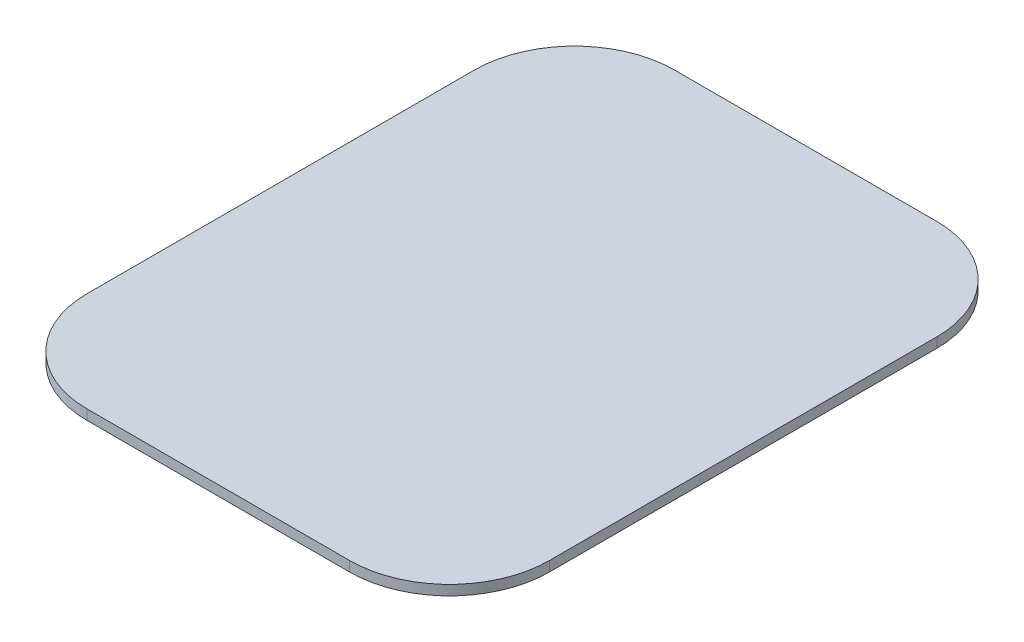
ISO-10303-21;
HEADER;
FILE_DESCRIPTION(('STEP AP214'),'2;1');
FILE_NAME('part.step','',(''),(''),'','','');
FILE_SCHEMA(('AUTOMOTIVE_DESIGN { 1 0 10303 214 1 1 1 1 }'));
ENDSEC;
DATA;
#1=APPLICATION_CONTEXT('core data for automotive mechanical design processes');
#2=APPLICATION_PROTOCOL_DEFINITION('international standard','automotive_design',2000,#1);
#3=PRODUCT_CONTEXT('',#1,'mechanical');
#4=PRODUCT('Part','Part','',(#3));
#5=PRODUCT_RELATED_PRODUCT_CATEGORY('part','',(#4));
#6=PRODUCT_DEFINITION_FORMATION('','',#4);
#7=PRODUCT_DEFINITION_CONTEXT('part definition',#1,'design');
#8=PRODUCT_DEFINITION('design','',#6,#7);
#9=PRODUCT_DEFINITION_SHAPE('','',#8);
#10=(LENGTH_UNIT() NAMED_UNIT(*) SI_UNIT(.MILLI.,.METRE.));
#11=(NAMED_UNIT(*) PLANE_ANGLE_UNIT() SI_UNIT($,.RADIAN.));
#12=(NAMED_UNIT(*) SI_UNIT($,.STERADIAN.) SOLID_ANGLE_UNIT());
#13=UNCERTAINTY_MEASURE_WITH_UNIT(LENGTH_MEASURE(1.E-05),#10,'distance_accuracy_value','');
#14=(GEOMETRIC_REPRESENTATION_CONTEXT(3) GLOBAL_UNCERTAINTY_ASSIGNED_CONTEXT((#13)) GLOBAL_UNIT_ASSIGNED_CONTEXT((#10,
#11,#12)) REPRESENTATION_CONTEXT('',''));
#15=CARTESIAN_POINT('',(0.,0.,0.));
#16=DIRECTION('',(0.,0.,1.));
#17=DIRECTION('',(1.,0.,0.));
#18=AXIS2_PLACEMENT_3D('',#15,#16,#17);
#19=CARTESIAN_POINT('',(92.5,4.,117.5));
#20=DIRECTION('',(-1.,0.,0.));
#21=DIRECTION('',(0.,0.,1.));
#22=AXIS2_PLACEMENT_3D('',#19,#20,#21);
#23=PLANE('',#22);
#24=DIRECTION('',(0.,0.,-1.));
#25=VECTOR('',#24,1.);
#26=CARTESIAN_POINT('',(92.5,0.,117.5));
#27=LINE('',#26,#25);
#28=CARTESIAN_POINT('',(92.5,0.,77.5));
#29=VERTEX_POINT('',#28);
#30=CARTESIAN_POINT('',(92.5,0.,-77.5));
#31=VERTEX_POINT('',#30);
#32=EDGE_CURVE('E140',#29,#31,#27,.T.);
#33=ORIENTED_EDGE('',*,*,#32,.T.);
#34=DIRECTION('',(0.,-1.,0.));
#35=VECTOR('',#34,1.);
#36=CARTESIAN_POINT('',(92.5,4.,-77.5));
#37=LINE('',#36,#35);
#38=CARTESIAN_POINT('',(92.5,4.,-77.5));
#39=VERTEX_POINT('',#38);
#40=EDGE_CURVE('E174',#31,#39,#37,.F.);
#41=ORIENTED_EDGE('',*,*,#40,.T.);
#42=DIRECTION('',(0.,0.,-1.));
#43=VECTOR('',#42,1.);
#44=CARTESIAN_POINT('',(92.5,4.,117.5));
#45=LINE('',#44,#43);
#46=CARTESIAN_POINT('',(92.5,4.,77.5));
#47=VERTEX_POINT('',#46);
#48=EDGE_CURVE('E138',#47,#39,#45,.T.);
#49=ORIENTED_EDGE('',*,*,#48,.F.);
#50=DIRECTION('',(0.,-1.,0.));
#51=VECTOR('',#50,1.);
#52=CARTESIAN_POINT('',(92.5,4.,77.5));
#53=LINE('',#52,#51);
#54=EDGE_CURVE('E170',#47,#29,#53,.T.);
#55=ORIENTED_EDGE('',*,*,#54,.T.);
#56=EDGE_LOOP('',(#33,#41,#49,#55));
#57=FACE_BOUND('',#56,.T.);
#58=ADVANCED_FACE('F39',(#57),#23,.F.);
#59=CARTESIAN_POINT('',(-92.5,4.,-117.5));
#60=DIRECTION('',(0.,0.,1.));
#61=DIRECTION('',(1.,0.,0.));
#62=AXIS2_PLACEMENT_3D('',#59,#60,#61);
#63=PLANE('',#62);
#64=DIRECTION('',(-1.,0.,0.));
#65=VECTOR('',#64,1.);
#66=CARTESIAN_POINT('',(-92.5,0.,-117.5));
#67=LINE('',#66,#65);
#68=CARTESIAN_POINT('',(52.5,0.,-117.5));
#69=VERTEX_POINT('',#68);
#70=CARTESIAN_POINT('',(-52.5,0.,-117.5));
#71=VERTEX_POINT('',#70);
#72=EDGE_CURVE('E134',#69,#71,#67,.T.);
#73=ORIENTED_EDGE('',*,*,#72,.T.);
#74=DIRECTION('',(0.,-1.,0.));
#75=VECTOR('',#74,1.);
#76=CARTESIAN_POINT('',(-52.5,4.,-117.5));
#77=LINE('',#76,#75);
#78=CARTESIAN_POINT('',(-52.5,4.,-117.5));
#79=VERTEX_POINT('',#78);
#80=EDGE_CURVE('E110',#71,#79,#77,.F.);
#81=ORIENTED_EDGE('',*,*,#80,.T.);
#82=DIRECTION('',(-1.,0.,0.));
#83=VECTOR('',#82,1.);
#84=CARTESIAN_POINT('',(-92.5,4.,-117.5));
#85=LINE('',#84,#83);
#86=CARTESIAN_POINT('',(52.5,4.,-117.5));
#87=VERTEX_POINT('',#86);
#88=EDGE_CURVE('E193',#87,#79,#85,.T.);
#89=ORIENTED_EDGE('',*,*,#88,.F.);
#90=DIRECTION('',(0.,-1.,0.));
#91=VECTOR('',#90,1.);
#92=CARTESIAN_POINT('',(52.5,4.,-117.5));
#93=LINE('',#92,#91);
#94=EDGE_CURVE('E116',#87,#69,#93,.T.);
#95=ORIENTED_EDGE('',*,*,#94,.T.);
#96=EDGE_LOOP('',(#73,#81,#89,#95));
#97=FACE_BOUND('',#96,.T.);
#98=ADVANCED_FACE('F214',(#97),#63,.F.);
#99=CARTESIAN_POINT('',(-92.5,4.,117.5));
#100=DIRECTION('',(1.,0.,0.));
#101=DIRECTION('',(0.,0.,-1.));
#102=AXIS2_PLACEMENT_3D('',#99,#100,#101);
#103=PLANE('',#102);
#104=DIRECTION('',(0.,0.,1.));
#105=VECTOR('',#104,1.);
#106=CARTESIAN_POINT('',(-92.5,4.,117.5));
#107=LINE('',#106,#105);
#108=CARTESIAN_POINT('',(-92.5,4.,-77.5));
#109=VERTEX_POINT('',#108);
#110=CARTESIAN_POINT('',(-92.5,4.,77.5));
#111=VERTEX_POINT('',#110);
#112=EDGE_CURVE('E125',#109,#111,#107,.T.);
#113=ORIENTED_EDGE('',*,*,#112,.F.);
#114=DIRECTION('',(0.,-1.,0.));
#115=VECTOR('',#114,1.);
#116=CARTESIAN_POINT('',(-92.5,4.,-77.5));
#117=LINE('',#116,#115);
#118=CARTESIAN_POINT('',(-92.5,0.,-77.5));
#119=VERTEX_POINT('',#118);
#120=EDGE_CURVE('E109',#109,#119,#117,.T.);
#121=ORIENTED_EDGE('',*,*,#120,.T.);
#122=DIRECTION('',(0.,0.,1.));
#123=VECTOR('',#122,1.);
#124=CARTESIAN_POINT('',(-92.5,0.,117.5));
#125=LINE('',#124,#123);
#126=CARTESIAN_POINT('',(-92.5,0.,77.5));
#127=VERTEX_POINT('',#126);
#128=EDGE_CURVE('E123',#119,#127,#125,.T.);
#129=ORIENTED_EDGE('',*,*,#128,.T.);
#130=DIRECTION('',(0.,-1.,0.));
#131=VECTOR('',#130,1.);
#132=CARTESIAN_POINT('',(-92.5,4.,77.5));
#133=LINE('',#132,#131);
#134=EDGE_CURVE('E128',#127,#111,#133,.F.);
#135=ORIENTED_EDGE('',*,*,#134,.T.);
#136=EDGE_LOOP('',(#113,#121,#129,#135));
#137=FACE_BOUND('',#136,.T.);
#138=ADVANCED_FACE('F122',(#137),#103,.F.);
#139=CARTESIAN_POINT('',(-92.5,4.,117.5));
#140=DIRECTION('',(0.,0.,-1.));
#141=DIRECTION('',(-1.,0.,0.));
#142=AXIS2_PLACEMENT_3D('',#139,#140,#141);
#143=PLANE('',#142);
#144=DIRECTION('',(1.,0.,0.));
#145=VECTOR('',#144,1.);
#146=CARTESIAN_POINT('',(-92.5,0.,117.5));
#147=LINE('',#146,#145);
#148=CARTESIAN_POINT('',(-52.5,0.,117.5));
#149=VERTEX_POINT('',#148);
#150=CARTESIAN_POINT('',(52.5,0.,117.5));
#151=VERTEX_POINT('',#150);
#152=EDGE_CURVE('E133',#149,#151,#147,.T.);
#153=ORIENTED_EDGE('',*,*,#152,.T.);
#154=DIRECTION('',(0.,-1.,0.));
#155=VECTOR('',#154,1.);
#156=CARTESIAN_POINT('',(52.5,4.,117.5));
#157=LINE('',#156,#155);
#158=CARTESIAN_POINT('',(52.5,4.,117.5));
#159=VERTEX_POINT('',#158);
#160=EDGE_CURVE('E11',#151,#159,#157,.F.);
#161=ORIENTED_EDGE('',*,*,#160,.T.);
#162=DIRECTION('',(1.,0.,0.));
#163=VECTOR('',#162,1.);
#164=CARTESIAN_POINT('',(-92.5,4.,117.5));
#165=LINE('',#164,#163);
#166=CARTESIAN_POINT('',(-52.5,4.,117.5));
#167=VERTEX_POINT('',#166);
#168=EDGE_CURVE('E145',#167,#159,#165,.T.);
#169=ORIENTED_EDGE('',*,*,#168,.F.);
#170=DIRECTION('',(0.,-1.,0.));
#171=VECTOR('',#170,1.);
#172=CARTESIAN_POINT('',(-52.5,4.,117.5));
#173=LINE('',#172,#171);
#174=EDGE_CURVE('E48',#167,#149,#173,.T.);
#175=ORIENTED_EDGE('',*,*,#174,.T.);
#176=EDGE_LOOP('',(#153,#161,#169,#175));
#177=FACE_BOUND('',#176,.T.);
#178=ADVANCED_FACE('F179',(#177),#143,.F.);
#179=CARTESIAN_POINT('',(0.,4.,0.));
#180=DIRECTION('',(0.,-1.,0.));
#181=DIRECTION('',(0.,0.,-1.));
#182=AXIS2_PLACEMENT_3D('',#179,#180,#181);
#183=PLANE('',#182);
#184=ORIENTED_EDGE('',*,*,#88,.T.);
#185=CARTESIAN_POINT('',(-52.5,4.,-77.5));
#186=DIRECTION('',(0.,-1.,0.));
#187=DIRECTION('',(0.,0.,-1.));
#188=AXIS2_PLACEMENT_3D('',#185,#186,#187);
#189=CIRCLE('',#188,40.);
#190=EDGE_CURVE('E167',#79,#109,#189,.F.);
#191=ORIENTED_EDGE('',*,*,#190,.T.);
#192=ORIENTED_EDGE('',*,*,#112,.T.);
#193=CARTESIAN_POINT('',(-52.5,4.,77.5));
#194=DIRECTION('',(0.,-1.,0.));
#195=DIRECTION('',(0.,0.,-1.));
#196=AXIS2_PLACEMENT_3D('',#193,#194,#195);
#197=CIRCLE('',#196,40.);
#198=EDGE_CURVE('E60',#111,#167,#197,.F.);
#199=ORIENTED_EDGE('',*,*,#198,.T.);
#200=ORIENTED_EDGE('',*,*,#168,.T.);
#201=CARTESIAN_POINT('',(52.5,4.,77.5));
#202=DIRECTION('',(0.,-1.,0.));
#203=DIRECTION('',(0.,0.,-1.));
#204=AXIS2_PLACEMENT_3D('',#201,#202,#203);
#205=CIRCLE('',#204,40.);
#206=EDGE_CURVE('E161',#159,#47,#205,.F.);
#207=ORIENTED_EDGE('',*,*,#206,.T.);
#208=ORIENTED_EDGE('',*,*,#48,.T.);
#209=CARTESIAN_POINT('',(52.5,4.,-77.5));
#210=DIRECTION('',(0.,-1.,0.));
#211=DIRECTION('',(0.,0.,-1.));
#212=AXIS2_PLACEMENT_3D('',#209,#210,#211);
#213=CIRCLE('',#212,40.);
#214=EDGE_CURVE('E164',#39,#87,#213,.F.);
#215=ORIENTED_EDGE('',*,*,#214,.T.);
#216=EDGE_LOOP('',(#184,#191,#192,#199,#200,#207,#208,#215));
#217=FACE_BOUND('',#216,.T.);
#218=ADVANCED_FACE('F203',(#217),#183,.F.);
#219=CARTESIAN_POINT('',(0.,0.,0.));
#220=DIRECTION('',(0.,-1.,0.));
#221=DIRECTION('',(0.,0.,-1.));
#222=AXIS2_PLACEMENT_3D('',#219,#220,#221);
#223=PLANE('',#222);
#224=ORIENTED_EDGE('',*,*,#128,.F.);
#225=CARTESIAN_POINT('',(-52.5,0.,-77.5));
#226=DIRECTION('',(0.,-1.,0.));
#227=DIRECTION('',(0.,0.,-1.));
#228=AXIS2_PLACEMENT_3D('',#225,#226,#227);
#229=CIRCLE('',#228,40.);
#230=EDGE_CURVE('E105',#119,#71,#229,.T.);
#231=ORIENTED_EDGE('',*,*,#230,.T.);
#232=ORIENTED_EDGE('',*,*,#72,.F.);
#233=CARTESIAN_POINT('',(52.5,0.,-77.5));
#234=DIRECTION('',(0.,-1.,0.));
#235=DIRECTION('',(0.,0.,-1.));
#236=AXIS2_PLACEMENT_3D('',#233,#234,#235);
#237=CIRCLE('',#236,40.);
#238=EDGE_CURVE('E117',#69,#31,#237,.T.);
#239=ORIENTED_EDGE('',*,*,#238,.T.);
#240=ORIENTED_EDGE('',*,*,#32,.F.);
#241=CARTESIAN_POINT('',(52.5,0.,77.5));
#242=DIRECTION('',(0.,-1.,0.));
#243=DIRECTION('',(0.,0.,-1.));
#244=AXIS2_PLACEMENT_3D('',#241,#242,#243);
#245=CIRCLE('',#244,40.);
#246=EDGE_CURVE('E149',#29,#151,#245,.T.);
#247=ORIENTED_EDGE('',*,*,#246,.T.);
#248=ORIENTED_EDGE('',*,*,#152,.F.);
#249=CARTESIAN_POINT('',(-52.5,0.,77.5));
#250=DIRECTION('',(0.,-1.,0.));
#251=DIRECTION('',(0.,0.,-1.));
#252=AXIS2_PLACEMENT_3D('',#249,#250,#251);
#253=CIRCLE('',#252,40.);
#254=EDGE_CURVE('E127',#149,#127,#253,.T.);
#255=ORIENTED_EDGE('',*,*,#254,.T.);
#256=EDGE_LOOP('',(#224,#231,#232,#239,#240,#247,#248,#255));
#257=FACE_BOUND('',#256,.T.);
#258=ADVANCED_FACE('F130',(#257),#223,.T.);
#259=CARTESIAN_POINT('',(-52.5,4.,-77.5));
#260=DIRECTION('',(0.,-1.,0.));
#261=DIRECTION('',(0.,0.,-1.));
#262=AXIS2_PLACEMENT_3D('',#259,#260,#261);
#263=CYLINDRICAL_SURFACE('',#262,40.);
#264=ORIENTED_EDGE('',*,*,#190,.F.);
#265=ORIENTED_EDGE('',*,*,#80,.F.);
#266=ORIENTED_EDGE('',*,*,#230,.F.);
#267=ORIENTED_EDGE('',*,*,#120,.F.);
#268=EDGE_LOOP('',(#264,#265,#266,#267));
#269=FACE_BOUND('',#268,.T.);
#270=ADVANCED_FACE('F108',(#269),#263,.T.);
#271=CARTESIAN_POINT('',(52.5,4.,-77.5));
#272=DIRECTION('',(0.,-1.,0.));
#273=DIRECTION('',(0.,0.,-1.));
#274=AXIS2_PLACEMENT_3D('',#271,#272,#273);
#275=CYLINDRICAL_SURFACE('',#274,40.);
#276=ORIENTED_EDGE('',*,*,#214,.F.);
#277=ORIENTED_EDGE('',*,*,#40,.F.);
#278=ORIENTED_EDGE('',*,*,#238,.F.);
#279=ORIENTED_EDGE('',*,*,#94,.F.);
#280=EDGE_LOOP('',(#276,#277,#278,#279));
#281=FACE_BOUND('',#280,.T.);
#282=ADVANCED_FACE('F225',(#281),#275,.T.);
#283=CARTESIAN_POINT('',(52.5,4.,77.5));
#284=DIRECTION('',(0.,-1.,0.));
#285=DIRECTION('',(0.,0.,-1.));
#286=AXIS2_PLACEMENT_3D('',#283,#284,#285);
#287=CYLINDRICAL_SURFACE('',#286,40.);
#288=ORIENTED_EDGE('',*,*,#206,.F.);
#289=ORIENTED_EDGE('',*,*,#160,.F.);
#290=ORIENTED_EDGE('',*,*,#246,.F.);
#291=ORIENTED_EDGE('',*,*,#54,.F.);
#292=EDGE_LOOP('',(#288,#289,#290,#291));
#293=FACE_BOUND('',#292,.T.);
#294=ADVANCED_FACE('F186',(#293),#287,.T.);
#295=CARTESIAN_POINT('',(-52.5,4.,77.5));
#296=DIRECTION('',(0.,-1.,0.));
#297=DIRECTION('',(0.,0.,-1.));
#298=AXIS2_PLACEMENT_3D('',#295,#296,#297);
#299=CYLINDRICAL_SURFACE('',#298,40.);
#300=ORIENTED_EDGE('',*,*,#198,.F.);
#301=ORIENTED_EDGE('',*,*,#134,.F.);
#302=ORIENTED_EDGE('',*,*,#254,.F.);
#303=ORIENTED_EDGE('',*,*,#174,.F.);
#304=EDGE_LOOP('',(#300,#301,#302,#303));
#305=FACE_BOUND('',#304,.T.);
#306=ADVANCED_FACE('F41',(#305),#299,.T.);
#307=CLOSED_SHELL('',(#58,#98,#138,#178,#218,#258,#270,#282,#294,#306));
#308=MANIFOLD_SOLID_BREP('B2',#307);
#309=ADVANCED_BREP_SHAPE_REPRESENTATION('',(#18,#308),#14);
#310=SHAPE_DEFINITION_REPRESENTATION(#9,#309);
ENDSEC;
END-ISO-10303-21;
